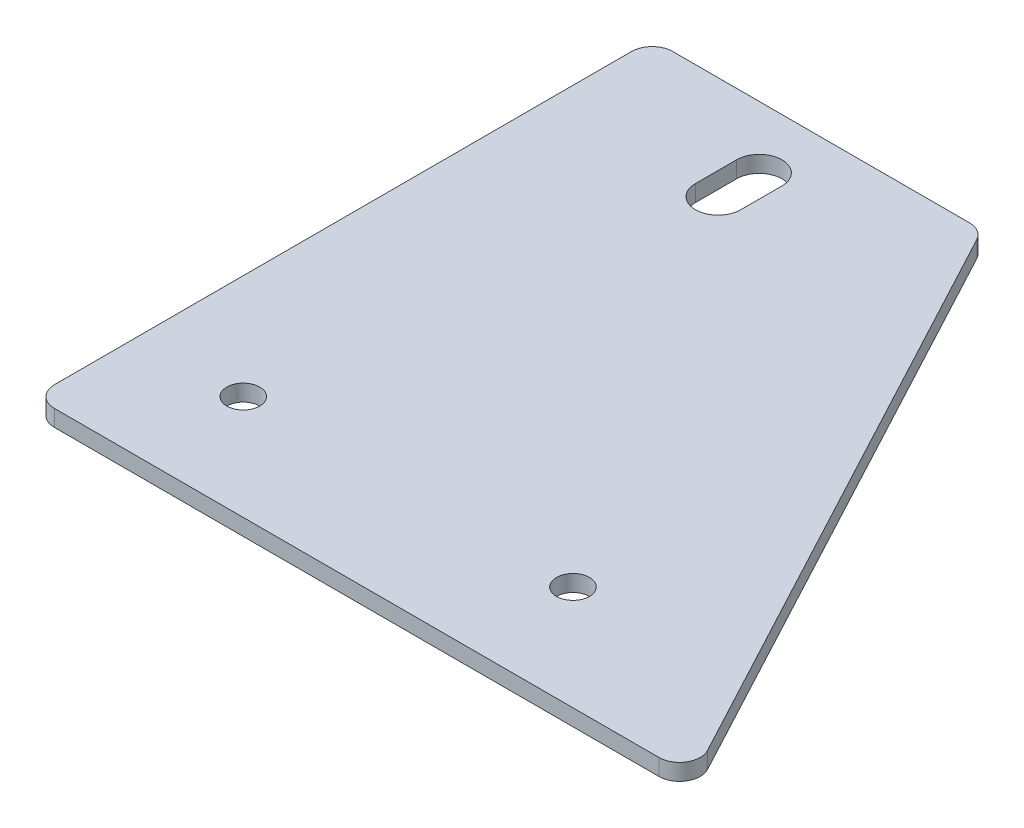
ISO-10303-21;
HEADER;
FILE_DESCRIPTION(('STEP AP214'),'2;1');
FILE_NAME('part.step','',(''),(''),'','','');
FILE_SCHEMA(('AUTOMOTIVE_DESIGN { 1 0 10303 214 1 1 1 1 }'));
ENDSEC;
DATA;
#1=APPLICATION_CONTEXT('core data for automotive mechanical design processes');
#2=APPLICATION_PROTOCOL_DEFINITION('international standard','automotive_design',2000,#1);
#3=PRODUCT_CONTEXT('',#1,'mechanical');
#4=PRODUCT('Part','Part','',(#3));
#5=PRODUCT_RELATED_PRODUCT_CATEGORY('part','',(#4));
#6=PRODUCT_DEFINITION_FORMATION('','',#4);
#7=PRODUCT_DEFINITION_CONTEXT('part definition',#1,'design');
#8=PRODUCT_DEFINITION('design','',#6,#7);
#9=PRODUCT_DEFINITION_SHAPE('','',#8);
#10=(LENGTH_UNIT() NAMED_UNIT(*) SI_UNIT(.MILLI.,.METRE.));
#11=(NAMED_UNIT(*) PLANE_ANGLE_UNIT() SI_UNIT($,.RADIAN.));
#12=(NAMED_UNIT(*) SI_UNIT($,.STERADIAN.) SOLID_ANGLE_UNIT());
#13=UNCERTAINTY_MEASURE_WITH_UNIT(LENGTH_MEASURE(1.E-05),#10,'distance_accuracy_value','');
#14=(GEOMETRIC_REPRESENTATION_CONTEXT(3) GLOBAL_UNCERTAINTY_ASSIGNED_CONTEXT((#13)) GLOBAL_UNIT_ASSIGNED_CONTEXT((#10,
#11,#12)) REPRESENTATION_CONTEXT('',''));
#15=CARTESIAN_POINT('',(0.,0.,0.));
#16=DIRECTION('',(0.,0.,1.));
#17=DIRECTION('',(1.,0.,0.));
#18=AXIS2_PLACEMENT_3D('',#15,#16,#17);
#19=CARTESIAN_POINT('',(-36.,4.,-145.));
#20=DIRECTION('',(0.,-1.,0.));
#21=DIRECTION('',(0.,0.,-1.));
#22=AXIS2_PLACEMENT_3D('',#19,#20,#21);
#23=CYLINDRICAL_SURFACE('',#22,5.);
#24=CARTESIAN_POINT('',(-36.,0.,-145.));
#25=DIRECTION('',(0.,1.,0.));
#26=DIRECTION('',(0.,0.,1.));
#27=AXIS2_PLACEMENT_3D('',#24,#25,#26);
#28=CIRCLE('',#27,5.);
#29=CARTESIAN_POINT('',(-36.,0.,-150.));
#30=VERTEX_POINT('',#29);
#31=CARTESIAN_POINT('',(-41.,0.,-145.));
#32=VERTEX_POINT('',#31);
#33=EDGE_CURVE('E214',#30,#32,#28,.T.);
#34=ORIENTED_EDGE('',*,*,#33,.T.);
#35=DIRECTION('',(0.,-1.,0.));
#36=VECTOR('',#35,1.);
#37=CARTESIAN_POINT('',(-41.,4.,-145.));
#38=LINE('',#37,#36);
#39=CARTESIAN_POINT('',(-41.,4.,-145.));
#40=VERTEX_POINT('',#39);
#41=EDGE_CURVE('E255',#40,#32,#38,.T.);
#42=ORIENTED_EDGE('',*,*,#41,.F.);
#43=CARTESIAN_POINT('',(-36.,4.,-145.));
#44=DIRECTION('',(0.,1.,0.));
#45=DIRECTION('',(0.,0.,1.));
#46=AXIS2_PLACEMENT_3D('',#43,#44,#45);
#47=CIRCLE('',#46,5.);
#48=CARTESIAN_POINT('',(-36.,4.,-150.));
#49=VERTEX_POINT('',#48);
#50=EDGE_CURVE('E189',#49,#40,#47,.T.);
#51=ORIENTED_EDGE('',*,*,#50,.F.);
#52=DIRECTION('',(0.,-1.,0.));
#53=VECTOR('',#52,1.);
#54=CARTESIAN_POINT('',(-36.,4.,-150.));
#55=LINE('',#54,#53);
#56=EDGE_CURVE('E213',#49,#30,#55,.T.);
#57=ORIENTED_EDGE('',*,*,#56,.T.);
#58=EDGE_LOOP('',(#34,#42,#51,#57));
#59=FACE_BOUND('',#58,.T.);
#60=ADVANCED_FACE('F47',(#59),#23,.T.);
#61=CARTESIAN_POINT('',(-41.,4.,-145.));
#62=DIRECTION('',(1.,0.,0.));
#63=DIRECTION('',(0.,0.,-1.));
#64=AXIS2_PLACEMENT_3D('',#61,#62,#63);
#65=PLANE('',#64);
#66=DIRECTION('',(0.,0.,1.));
#67=VECTOR('',#66,1.);
#68=CARTESIAN_POINT('',(-41.,0.,-145.));
#69=LINE('',#68,#67);
#70=CARTESIAN_POINT('',(-41.,0.,-5.));
#71=VERTEX_POINT('',#70);
#72=EDGE_CURVE('E218',#32,#71,#69,.T.);
#73=ORIENTED_EDGE('',*,*,#72,.T.);
#74=DIRECTION('',(0.,-1.,0.));
#75=VECTOR('',#74,1.);
#76=CARTESIAN_POINT('',(-41.,4.,-5.));
#77=LINE('',#76,#75);
#78=CARTESIAN_POINT('',(-41.,4.,-5.));
#79=VERTEX_POINT('',#78);
#80=EDGE_CURVE('E56',#71,#79,#77,.F.);
#81=ORIENTED_EDGE('',*,*,#80,.T.);
#82=DIRECTION('',(0.,0.,1.));
#83=VECTOR('',#82,1.);
#84=CARTESIAN_POINT('',(-41.,4.,-145.));
#85=LINE('',#84,#83);
#86=EDGE_CURVE('E193',#40,#79,#85,.T.);
#87=ORIENTED_EDGE('',*,*,#86,.F.);
#88=ORIENTED_EDGE('',*,*,#41,.T.);
#89=EDGE_LOOP('',(#73,#81,#87,#88));
#90=FACE_BOUND('',#89,.T.);
#91=ADVANCED_FACE('F395',(#90),#65,.F.);
#92=CARTESIAN_POINT('',(-41.,4.,0.));
#93=DIRECTION('',(0.,0.,-1.));
#94=DIRECTION('',(-1.,0.,0.));
#95=AXIS2_PLACEMENT_3D('',#92,#93,#94);
#96=PLANE('',#95);
#97=DIRECTION('',(1.,0.,0.));
#98=VECTOR('',#97,1.);
#99=CARTESIAN_POINT('',(-41.,4.,0.));
#100=LINE('',#99,#98);
#101=CARTESIAN_POINT('',(-36.,4.,0.));
#102=VERTEX_POINT('',#101);
#103=CARTESIAN_POINT('',(110.666666666667,4.,0.));
#104=VERTEX_POINT('',#103);
#105=EDGE_CURVE('E197',#102,#104,#100,.T.);
#106=ORIENTED_EDGE('',*,*,#105,.F.);
#107=DIRECTION('',(0.,-1.,0.));
#108=VECTOR('',#107,1.);
#109=CARTESIAN_POINT('',(-36.,4.,0.));
#110=LINE('',#109,#108);
#111=CARTESIAN_POINT('',(-36.,0.,0.));
#112=VERTEX_POINT('',#111);
#113=EDGE_CURVE('E259',#102,#112,#110,.T.);
#114=ORIENTED_EDGE('',*,*,#113,.T.);
#115=DIRECTION('',(1.,0.,0.));
#116=VECTOR('',#115,1.);
#117=CARTESIAN_POINT('',(-41.,0.,0.));
#118=LINE('',#117,#116);
#119=CARTESIAN_POINT('',(110.666666666667,0.,0.));
#120=VERTEX_POINT('',#119);
#121=EDGE_CURVE('E222',#112,#120,#118,.T.);
#122=ORIENTED_EDGE('',*,*,#121,.T.);
#123=DIRECTION('',(0.,-1.,0.));
#124=VECTOR('',#123,1.);
#125=CARTESIAN_POINT('',(110.666666666667,4.,0.));
#126=LINE('',#125,#124);
#127=EDGE_CURVE('E251',#104,#120,#126,.T.);
#128=ORIENTED_EDGE('',*,*,#127,.F.);
#129=EDGE_LOOP('',(#106,#114,#122,#128));
#130=FACE_BOUND('',#129,.T.);
#131=ADVANCED_FACE('F377',(#130),#96,.F.);
#132=CARTESIAN_POINT('',(110.666666666667,4.,-5.));
#133=DIRECTION('',(0.,-1.,0.));
#134=DIRECTION('',(0.,0.,-1.));
#135=AXIS2_PLACEMENT_3D('',#132,#133,#134);
#136=CYLINDRICAL_SURFACE('',#135,4.99999999999999);
#137=CARTESIAN_POINT('',(110.666666666667,0.,-5.));
#138=DIRECTION('',(0.,-1.,0.));
#139=DIRECTION('',(0.,0.,-1.));
#140=AXIS2_PLACEMENT_3D('',#137,#138,#139);
#141=CIRCLE('',#140,4.99999999999999);
#142=CARTESIAN_POINT('',(115.078431372549,0.,-7.35294117647058));
#143=VERTEX_POINT('',#142);
#144=EDGE_CURVE('E225',#143,#120,#141,.T.);
#145=ORIENTED_EDGE('',*,*,#144,.F.);
#146=DIRECTION('',(0.,-1.,0.));
#147=VECTOR('',#146,1.);
#148=CARTESIAN_POINT('',(115.078431372549,4.,-7.35294117647058));
#149=LINE('',#148,#147);
#150=CARTESIAN_POINT('',(115.078431372549,4.,-7.35294117647058));
#151=VERTEX_POINT('',#150);
#152=EDGE_CURVE('E248',#151,#143,#149,.T.);
#153=ORIENTED_EDGE('',*,*,#152,.F.);
#154=CARTESIAN_POINT('',(110.666666666667,4.,-5.));
#155=DIRECTION('',(0.,-1.,0.));
#156=DIRECTION('',(0.,0.,-1.));
#157=AXIS2_PLACEMENT_3D('',#154,#155,#156);
#158=CIRCLE('',#157,4.99999999999999);
#159=EDGE_CURVE('E200',#151,#104,#158,.T.);
#160=ORIENTED_EDGE('',*,*,#159,.T.);
#161=ORIENTED_EDGE('',*,*,#127,.T.);
#162=EDGE_LOOP('',(#145,#153,#160,#161));
#163=FACE_BOUND('',#162,.T.);
#164=ADVANCED_FACE('F380',(#163),#136,.T.);
#165=CARTESIAN_POINT('',(115.078431372549,4.,-7.35294117647058));
#166=DIRECTION('',(-0.882352941176471,0.,0.470588235294117));
#167=DIRECTION('',(0.470588235294117,0.,0.882352941176471));
#168=AXIS2_PLACEMENT_3D('',#165,#166,#167);
#169=PLANE('',#168);
#170=DIRECTION('',(-0.470588235294117,0.,-0.882352941176471));
#171=VECTOR('',#170,1.);
#172=CARTESIAN_POINT('',(115.078431372549,0.,-7.35294117647058));
#173=LINE('',#172,#171);
#174=CARTESIAN_POINT('',(40.4117647058823,0.,-147.352941176471));
#175=VERTEX_POINT('',#174);
#176=EDGE_CURVE('E229',#143,#175,#173,.T.);
#177=ORIENTED_EDGE('',*,*,#176,.T.);
#178=DIRECTION('',(0.,-1.,0.));
#179=VECTOR('',#178,1.);
#180=CARTESIAN_POINT('',(40.4117647058823,4.,-147.352941176471));
#181=LINE('',#180,#179);
#182=CARTESIAN_POINT('',(40.4117647058823,4.,-147.352941176471));
#183=VERTEX_POINT('',#182);
#184=EDGE_CURVE('E244',#183,#175,#181,.T.);
#185=ORIENTED_EDGE('',*,*,#184,.F.);
#186=DIRECTION('',(-0.470588235294117,0.,-0.882352941176471));
#187=VECTOR('',#186,1.);
#188=CARTESIAN_POINT('',(115.078431372549,4.,-7.35294117647058));
#189=LINE('',#188,#187);
#190=EDGE_CURVE('E204',#151,#183,#189,.T.);
#191=ORIENTED_EDGE('',*,*,#190,.F.);
#192=ORIENTED_EDGE('',*,*,#152,.T.);
#193=EDGE_LOOP('',(#177,#185,#191,#192));
#194=FACE_BOUND('',#193,.T.);
#195=ADVANCED_FACE('F406',(#194),#169,.F.);
#196=CARTESIAN_POINT('',(36.,4.,-145.));
#197=DIRECTION('',(0.,-1.,0.));
#198=DIRECTION('',(0.,0.,-1.));
#199=AXIS2_PLACEMENT_3D('',#196,#197,#198);
#200=CYLINDRICAL_SURFACE('',#199,4.99999999999998);
#201=CARTESIAN_POINT('',(36.,0.,-145.));
#202=DIRECTION('',(0.,1.,0.));
#203=DIRECTION('',(0.,0.,1.));
#204=AXIS2_PLACEMENT_3D('',#201,#202,#203);
#205=CIRCLE('',#204,4.99999999999998);
#206=CARTESIAN_POINT('',(36.,0.,-150.));
#207=VERTEX_POINT('',#206);
#208=EDGE_CURVE('E232',#175,#207,#205,.T.);
#209=ORIENTED_EDGE('',*,*,#208,.T.);
#210=DIRECTION('',(0.,-1.,0.));
#211=VECTOR('',#210,1.);
#212=CARTESIAN_POINT('',(36.,4.,-150.));
#213=LINE('',#212,#211);
#214=CARTESIAN_POINT('',(36.,4.,-150.));
#215=VERTEX_POINT('',#214);
#216=EDGE_CURVE('E240',#215,#207,#213,.T.);
#217=ORIENTED_EDGE('',*,*,#216,.F.);
#218=CARTESIAN_POINT('',(36.,4.,-145.));
#219=DIRECTION('',(0.,1.,0.));
#220=DIRECTION('',(0.,0.,1.));
#221=AXIS2_PLACEMENT_3D('',#218,#219,#220);
#222=CIRCLE('',#221,4.99999999999998);
#223=EDGE_CURVE('E207',#183,#215,#222,.T.);
#224=ORIENTED_EDGE('',*,*,#223,.F.);
#225=ORIENTED_EDGE('',*,*,#184,.T.);
#226=EDGE_LOOP('',(#209,#217,#224,#225));
#227=FACE_BOUND('',#226,.T.);
#228=ADVANCED_FACE('F409',(#227),#200,.T.);
#229=CARTESIAN_POINT('',(36.,4.,-150.));
#230=DIRECTION('',(0.,0.,1.));
#231=DIRECTION('',(1.,0.,0.));
#232=AXIS2_PLACEMENT_3D('',#229,#230,#231);
#233=PLANE('',#232);
#234=DIRECTION('',(-1.,0.,0.));
#235=VECTOR('',#234,1.);
#236=CARTESIAN_POINT('',(36.,0.,-150.));
#237=LINE('',#236,#235);
#238=EDGE_CURVE('E194',#207,#30,#237,.T.);
#239=ORIENTED_EDGE('',*,*,#238,.T.);
#240=ORIENTED_EDGE('',*,*,#56,.F.);
#241=DIRECTION('',(-1.,0.,0.));
#242=VECTOR('',#241,1.);
#243=CARTESIAN_POINT('',(36.,4.,-150.));
#244=LINE('',#243,#242);
#245=EDGE_CURVE('E210',#215,#49,#244,.T.);
#246=ORIENTED_EDGE('',*,*,#245,.F.);
#247=ORIENTED_EDGE('',*,*,#216,.T.);
#248=EDGE_LOOP('',(#239,#240,#246,#247));
#249=FACE_BOUND('',#248,.T.);
#250=ADVANCED_FACE('F413',(#249),#233,.F.);
#251=CARTESIAN_POINT('',(-36.,4.,-145.));
#252=DIRECTION('',(0.,1.,0.));
#253=DIRECTION('',(0.,0.,1.));
#254=AXIS2_PLACEMENT_3D('',#251,#252,#253);
#255=PLANE('',#254);
#256=CARTESIAN_POINT('',(-15.6,4.,-25.4));
#257=DIRECTION('',(0.,1.,0.));
#258=DIRECTION('',(0.,0.,1.));
#259=AXIS2_PLACEMENT_3D('',#256,#257,#258);
#260=CIRCLE('',#259,4.);
#261=CARTESIAN_POINT('',(-15.6,4.,-21.4));
#262=VERTEX_POINT('',#261);
#263=EDGE_CURVE('E318',#262,#262,#260,.T.);
#264=ORIENTED_EDGE('',*,*,#263,.F.);
#265=EDGE_LOOP('',(#264));
#266=FACE_BOUND('',#265,.T.);
#267=CARTESIAN_POINT('',(64.4,4.,-25.4));
#268=DIRECTION('',(0.,1.,0.));
#269=DIRECTION('',(0.,0.,1.));
#270=AXIS2_PLACEMENT_3D('',#267,#268,#269);
#271=CIRCLE('',#270,4.00000000000001);
#272=CARTESIAN_POINT('',(64.4,4.,-21.4));
#273=VERTEX_POINT('',#272);
#274=EDGE_CURVE('E170',#273,#273,#271,.T.);
#275=ORIENTED_EDGE('',*,*,#274,.F.);
#276=EDGE_LOOP('',(#275));
#277=FACE_BOUND('',#276,.T.);
#278=CARTESIAN_POINT('',(0.,4.,-135.));
#279=DIRECTION('',(0.,1.,0.));
#280=DIRECTION('',(0.,0.,1.));
#281=AXIS2_PLACEMENT_3D('',#278,#279,#280);
#282=CIRCLE('',#281,5.5);
#283=CARTESIAN_POINT('',(5.5,4.,-135.));
#284=VERTEX_POINT('',#283);
#285=CARTESIAN_POINT('',(-5.5,4.,-135.));
#286=VERTEX_POINT('',#285);
#287=EDGE_CURVE('E138',#284,#286,#282,.T.);
#288=ORIENTED_EDGE('',*,*,#287,.F.);
#289=DIRECTION('',(0.,0.,-1.));
#290=VECTOR('',#289,1.);
#291=CARTESIAN_POINT('',(5.5,4.,-135.));
#292=LINE('',#291,#290);
#293=CARTESIAN_POINT('',(5.5,4.,-125.));
#294=VERTEX_POINT('',#293);
#295=EDGE_CURVE('E149',#294,#284,#292,.T.);
#296=ORIENTED_EDGE('',*,*,#295,.F.);
#297=CARTESIAN_POINT('',(0.,4.,-125.));
#298=DIRECTION('',(0.,1.,0.));
#299=DIRECTION('',(0.,0.,1.));
#300=AXIS2_PLACEMENT_3D('',#297,#298,#299);
#301=CIRCLE('',#300,5.5);
#302=CARTESIAN_POINT('',(-5.5,4.,-125.));
#303=VERTEX_POINT('',#302);
#304=EDGE_CURVE('E155',#303,#294,#301,.T.);
#305=ORIENTED_EDGE('',*,*,#304,.F.);
#306=DIRECTION('',(0.,0.,1.));
#307=VECTOR('',#306,1.);
#308=CARTESIAN_POINT('',(-5.5,4.,-135.));
#309=LINE('',#308,#307);
#310=EDGE_CURVE('E161',#286,#303,#309,.T.);
#311=ORIENTED_EDGE('',*,*,#310,.F.);
#312=EDGE_LOOP('',(#288,#296,#305,#311));
#313=FACE_BOUND('',#312,.T.);
#314=ORIENTED_EDGE('',*,*,#86,.T.);
#315=CARTESIAN_POINT('',(-36.,4.,-5.00000000000001));
#316=DIRECTION('',(0.,1.,0.));
#317=DIRECTION('',(0.,0.,1.));
#318=AXIS2_PLACEMENT_3D('',#315,#316,#317);
#319=CIRCLE('',#318,5.);
#320=EDGE_CURVE('E11',#79,#102,#319,.T.);
#321=ORIENTED_EDGE('',*,*,#320,.T.);
#322=ORIENTED_EDGE('',*,*,#105,.T.);
#323=ORIENTED_EDGE('',*,*,#159,.F.);
#324=ORIENTED_EDGE('',*,*,#190,.T.);
#325=ORIENTED_EDGE('',*,*,#223,.T.);
#326=ORIENTED_EDGE('',*,*,#245,.T.);
#327=ORIENTED_EDGE('',*,*,#50,.T.);
#328=EDGE_LOOP('',(#314,#321,#322,#323,#324,#325,#326,#327));
#329=FACE_BOUND('',#328,.T.);
#330=ADVANCED_FACE('F158',(#266,#277,#313,#329),#255,.T.);
#331=CARTESIAN_POINT('',(-36.,0.,-145.));
#332=DIRECTION('',(0.,1.,0.));
#333=DIRECTION('',(0.,0.,1.));
#334=AXIS2_PLACEMENT_3D('',#331,#332,#333);
#335=PLANE('',#334);
#336=CARTESIAN_POINT('',(-15.6,0.,-25.4));
#337=DIRECTION('',(0.,1.,0.));
#338=DIRECTION('',(0.,0.,1.));
#339=AXIS2_PLACEMENT_3D('',#336,#337,#338);
#340=CIRCLE('',#339,4.);
#341=CARTESIAN_POINT('',(-15.6,0.,-21.4));
#342=VERTEX_POINT('',#341);
#343=EDGE_CURVE('E219',#342,#342,#340,.T.);
#344=ORIENTED_EDGE('',*,*,#343,.T.);
#345=EDGE_LOOP('',(#344));
#346=FACE_BOUND('',#345,.T.);
#347=CARTESIAN_POINT('',(64.4,0.,-25.4));
#348=DIRECTION('',(0.,1.,0.));
#349=DIRECTION('',(0.,0.,1.));
#350=AXIS2_PLACEMENT_3D('',#347,#348,#349);
#351=CIRCLE('',#350,4.00000000000001);
#352=CARTESIAN_POINT('',(64.4,0.,-21.4));
#353=VERTEX_POINT('',#352);
#354=EDGE_CURVE('E163',#353,#353,#351,.T.);
#355=ORIENTED_EDGE('',*,*,#354,.T.);
#356=EDGE_LOOP('',(#355));
#357=FACE_BOUND('',#356,.T.);
#358=DIRECTION('',(0.,0.,-1.));
#359=VECTOR('',#358,1.);
#360=CARTESIAN_POINT('',(5.5,0.,-135.));
#361=LINE('',#360,#359);
#362=CARTESIAN_POINT('',(5.5,0.,-125.));
#363=VERTEX_POINT('',#362);
#364=CARTESIAN_POINT('',(5.5,0.,-135.));
#365=VERTEX_POINT('',#364);
#366=EDGE_CURVE('E175',#363,#365,#361,.T.);
#367=ORIENTED_EDGE('',*,*,#366,.T.);
#368=CARTESIAN_POINT('',(0.,0.,-135.));
#369=DIRECTION('',(0.,1.,0.));
#370=DIRECTION('',(0.,0.,1.));
#371=AXIS2_PLACEMENT_3D('',#368,#369,#370);
#372=CIRCLE('',#371,5.5);
#373=CARTESIAN_POINT('',(-5.5,0.,-135.));
#374=VERTEX_POINT('',#373);
#375=EDGE_CURVE('E141',#365,#374,#372,.T.);
#376=ORIENTED_EDGE('',*,*,#375,.T.);
#377=DIRECTION('',(0.,0.,1.));
#378=VECTOR('',#377,1.);
#379=CARTESIAN_POINT('',(-5.5,0.,-135.));
#380=LINE('',#379,#378);
#381=CARTESIAN_POINT('',(-5.5,0.,-125.));
#382=VERTEX_POINT('',#381);
#383=EDGE_CURVE('E183',#374,#382,#380,.T.);
#384=ORIENTED_EDGE('',*,*,#383,.T.);
#385=CARTESIAN_POINT('',(0.,0.,-125.));
#386=DIRECTION('',(0.,1.,0.));
#387=DIRECTION('',(0.,0.,1.));
#388=AXIS2_PLACEMENT_3D('',#385,#386,#387);
#389=CIRCLE('',#388,5.5);
#390=EDGE_CURVE('E178',#382,#363,#389,.T.);
#391=ORIENTED_EDGE('',*,*,#390,.T.);
#392=EDGE_LOOP('',(#367,#376,#384,#391));
#393=FACE_BOUND('',#392,.T.);
#394=ORIENTED_EDGE('',*,*,#121,.F.);
#395=CARTESIAN_POINT('',(-36.,0.,-5.00000000000001));
#396=DIRECTION('',(0.,1.,0.));
#397=DIRECTION('',(0.,0.,1.));
#398=AXIS2_PLACEMENT_3D('',#395,#396,#397);
#399=CIRCLE('',#398,5.);
#400=EDGE_CURVE('E70',#112,#71,#399,.F.);
#401=ORIENTED_EDGE('',*,*,#400,.T.);
#402=ORIENTED_EDGE('',*,*,#72,.F.);
#403=ORIENTED_EDGE('',*,*,#33,.F.);
#404=ORIENTED_EDGE('',*,*,#238,.F.);
#405=ORIENTED_EDGE('',*,*,#208,.F.);
#406=ORIENTED_EDGE('',*,*,#176,.F.);
#407=ORIENTED_EDGE('',*,*,#144,.T.);
#408=EDGE_LOOP('',(#394,#401,#402,#403,#404,#405,#406,#407));
#409=FACE_BOUND('',#408,.T.);
#410=ADVANCED_FACE('F368',(#346,#357,#393,#409),#335,.F.);
#411=CARTESIAN_POINT('',(0.,0.,-135.));
#412=DIRECTION('',(0.,1.,0.));
#413=DIRECTION('',(0.,0.,1.));
#414=AXIS2_PLACEMENT_3D('',#411,#412,#413);
#415=CYLINDRICAL_SURFACE('',#414,5.5);
#416=ORIENTED_EDGE('',*,*,#287,.T.);
#417=DIRECTION('',(0.,1.,0.));
#418=VECTOR('',#417,1.);
#419=CARTESIAN_POINT('',(-5.5,0.,-135.));
#420=LINE('',#419,#418);
#421=EDGE_CURVE('E179',#374,#286,#420,.T.);
#422=ORIENTED_EDGE('',*,*,#421,.F.);
#423=ORIENTED_EDGE('',*,*,#375,.F.);
#424=DIRECTION('',(0.,1.,0.));
#425=VECTOR('',#424,1.);
#426=CARTESIAN_POINT('',(5.5,0.,-135.));
#427=LINE('',#426,#425);
#428=EDGE_CURVE('E134',#365,#284,#427,.T.);
#429=ORIENTED_EDGE('',*,*,#428,.T.);
#430=EDGE_LOOP('',(#416,#422,#423,#429));
#431=FACE_BOUND('',#430,.T.);
#432=ADVANCED_FACE('F136',(#431),#415,.F.);
#433=CARTESIAN_POINT('',(5.5,0.,-135.));
#434=DIRECTION('',(1.,0.,0.));
#435=DIRECTION('',(0.,0.,-1.));
#436=AXIS2_PLACEMENT_3D('',#433,#434,#435);
#437=PLANE('',#436);
#438=ORIENTED_EDGE('',*,*,#295,.T.);
#439=ORIENTED_EDGE('',*,*,#428,.F.);
#440=ORIENTED_EDGE('',*,*,#366,.F.);
#441=DIRECTION('',(0.,1.,0.));
#442=VECTOR('',#441,1.);
#443=CARTESIAN_POINT('',(5.5,0.,-125.));
#444=LINE('',#443,#442);
#445=EDGE_CURVE('E146',#363,#294,#444,.T.);
#446=ORIENTED_EDGE('',*,*,#445,.T.);
#447=EDGE_LOOP('',(#438,#439,#440,#446));
#448=FACE_BOUND('',#447,.T.);
#449=ADVANCED_FACE('F150',(#448),#437,.F.);
#450=CARTESIAN_POINT('',(0.,0.,-125.));
#451=DIRECTION('',(0.,1.,0.));
#452=DIRECTION('',(0.,0.,1.));
#453=AXIS2_PLACEMENT_3D('',#450,#451,#452);
#454=CYLINDRICAL_SURFACE('',#453,5.5);
#455=ORIENTED_EDGE('',*,*,#304,.T.);
#456=ORIENTED_EDGE('',*,*,#445,.F.);
#457=ORIENTED_EDGE('',*,*,#390,.F.);
#458=DIRECTION('',(0.,1.,0.));
#459=VECTOR('',#458,1.);
#460=CARTESIAN_POINT('',(-5.5,0.,-125.));
#461=LINE('',#460,#459);
#462=EDGE_CURVE('E349',#382,#303,#461,.T.);
#463=ORIENTED_EDGE('',*,*,#462,.T.);
#464=EDGE_LOOP('',(#455,#456,#457,#463));
#465=FACE_BOUND('',#464,.T.);
#466=ADVANCED_FACE('F363',(#465),#454,.F.);
#467=CARTESIAN_POINT('',(-5.5,0.,-135.));
#468=DIRECTION('',(-1.,0.,0.));
#469=DIRECTION('',(0.,0.,1.));
#470=AXIS2_PLACEMENT_3D('',#467,#468,#469);
#471=PLANE('',#470);
#472=ORIENTED_EDGE('',*,*,#310,.T.);
#473=ORIENTED_EDGE('',*,*,#462,.F.);
#474=ORIENTED_EDGE('',*,*,#383,.F.);
#475=ORIENTED_EDGE('',*,*,#421,.T.);
#476=EDGE_LOOP('',(#472,#473,#474,#475));
#477=FACE_BOUND('',#476,.T.);
#478=ADVANCED_FACE('F366',(#477),#471,.F.);
#479=CARTESIAN_POINT('',(64.4,0.,-25.4));
#480=DIRECTION('',(0.,1.,0.));
#481=DIRECTION('',(0.,0.,1.));
#482=AXIS2_PLACEMENT_3D('',#479,#480,#481);
#483=CYLINDRICAL_SURFACE('',#482,4.00000000000001);
#484=ORIENTED_EDGE('',*,*,#354,.F.);
#485=EDGE_LOOP('',(#484));
#486=FACE_BOUND('',#485,.T.);
#487=ORIENTED_EDGE('',*,*,#274,.T.);
#488=EDGE_LOOP('',(#487));
#489=FACE_BOUND('',#488,.T.);
#490=ADVANCED_FACE('F391',(#486,#489),#483,.F.);
#491=CARTESIAN_POINT('',(-15.6,0.,-25.4));
#492=DIRECTION('',(0.,1.,0.));
#493=DIRECTION('',(0.,0.,1.));
#494=AXIS2_PLACEMENT_3D('',#491,#492,#493);
#495=CYLINDRICAL_SURFACE('',#494,4.);
#496=ORIENTED_EDGE('',*,*,#343,.F.);
#497=EDGE_LOOP('',(#496));
#498=FACE_BOUND('',#497,.T.);
#499=ORIENTED_EDGE('',*,*,#263,.T.);
#500=EDGE_LOOP('',(#499));
#501=FACE_BOUND('',#500,.T.);
#502=ADVANCED_FACE('F387',(#498,#501),#495,.F.);
#503=CARTESIAN_POINT('',(-36.,4.,-5.00000000000001));
#504=DIRECTION('',(0.,-1.,0.));
#505=DIRECTION('',(0.,0.,-1.));
#506=AXIS2_PLACEMENT_3D('',#503,#504,#505);
#507=CYLINDRICAL_SURFACE('',#506,5.);
#508=ORIENTED_EDGE('',*,*,#320,.F.);
#509=ORIENTED_EDGE('',*,*,#80,.F.);
#510=ORIENTED_EDGE('',*,*,#400,.F.);
#511=ORIENTED_EDGE('',*,*,#113,.F.);
#512=EDGE_LOOP('',(#508,#509,#510,#511));
#513=FACE_BOUND('',#512,.T.);
#514=ADVANCED_FACE('F49',(#513),#507,.T.);
#515=CLOSED_SHELL('',(#60,#91,#131,#164,#195,#228,#250,#330,#410,#432,#449,#466,#478,#490,#502,#514));
#516=MANIFOLD_SOLID_BREP('B2',#515);
#517=ADVANCED_BREP_SHAPE_REPRESENTATION('',(#18,#516),#14);
#518=SHAPE_DEFINITION_REPRESENTATION(#9,#517);
ENDSEC;
END-ISO-10303-21;
